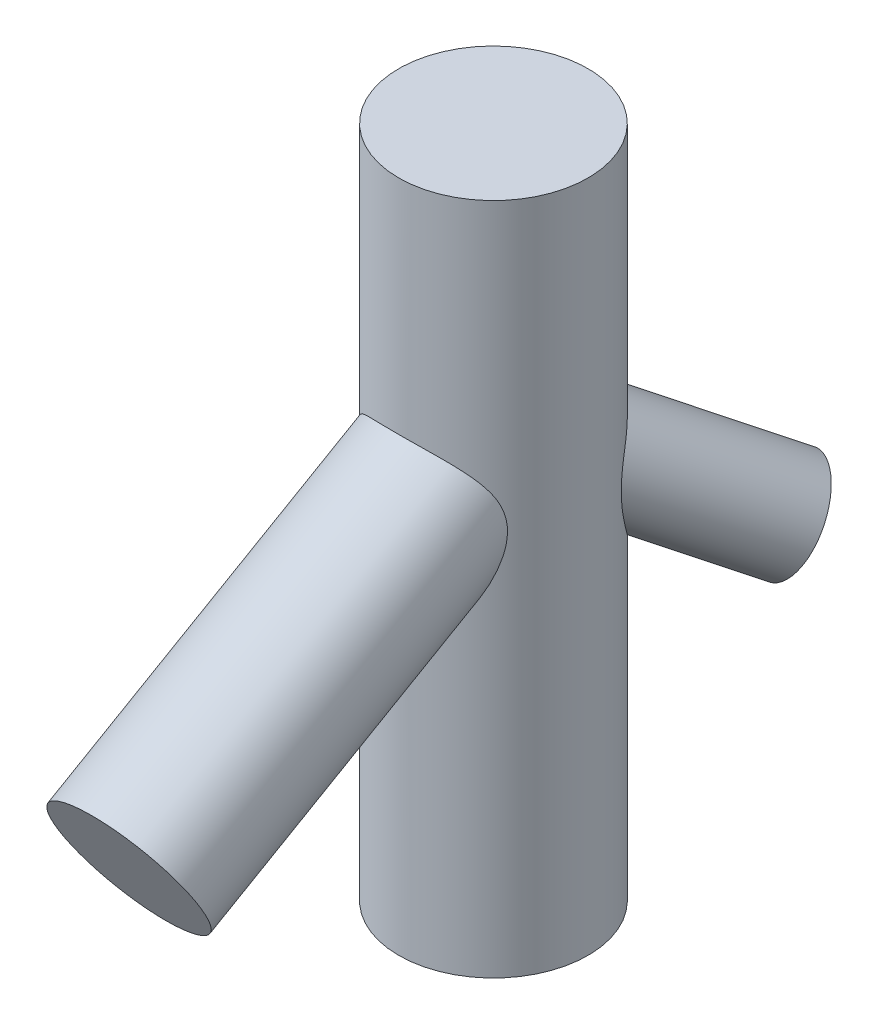
ISO-10303-21;
HEADER;
FILE_DESCRIPTION(('STEP AP214'),'2;1');
FILE_NAME('part.step','',(''),(''),'','','');
FILE_SCHEMA(('AUTOMOTIVE_DESIGN { 1 0 10303 214 1 1 1 1 }'));
ENDSEC;
DATA;
#1=APPLICATION_CONTEXT('core data for automotive mechanical design processes');
#2=APPLICATION_PROTOCOL_DEFINITION('international standard','automotive_design',2000,#1);
#3=PRODUCT_CONTEXT('',#1,'mechanical');
#4=PRODUCT('Part','Part','',(#3));
#5=PRODUCT_RELATED_PRODUCT_CATEGORY('part','',(#4));
#6=PRODUCT_DEFINITION_FORMATION('','',#4);
#7=PRODUCT_DEFINITION_CONTEXT('part definition',#1,'design');
#8=PRODUCT_DEFINITION('design','',#6,#7);
#9=PRODUCT_DEFINITION_SHAPE('','',#8);
#10=(LENGTH_UNIT() NAMED_UNIT(*) SI_UNIT(.MILLI.,.METRE.));
#11=(NAMED_UNIT(*) PLANE_ANGLE_UNIT() SI_UNIT($,.RADIAN.));
#12=(NAMED_UNIT(*) SI_UNIT($,.STERADIAN.) SOLID_ANGLE_UNIT());
#13=UNCERTAINTY_MEASURE_WITH_UNIT(LENGTH_MEASURE(1.E-05),#10,'distance_accuracy_value','');
#14=(GEOMETRIC_REPRESENTATION_CONTEXT(3) GLOBAL_UNCERTAINTY_ASSIGNED_CONTEXT((#13)) GLOBAL_UNIT_ASSIGNED_CONTEXT((#10,
#11,#12)) REPRESENTATION_CONTEXT('',''));
#15=CARTESIAN_POINT('',(0.,0.,0.));
#16=DIRECTION('',(0.,0.,1.));
#17=DIRECTION('',(1.,0.,0.));
#18=AXIS2_PLACEMENT_3D('',#15,#16,#17);
#19=CARTESIAN_POINT('',(0.,30.,0.));
#20=DIRECTION('',(0.,-1.,0.));
#21=DIRECTION('',(0.,0.,-1.));
#22=AXIS2_PLACEMENT_3D('',#19,#20,#21);
#23=CYLINDRICAL_SURFACE('',#22,11.25);
#24=CARTESIAN_POINT('',(4.1219677997383,0.232663328487408,-10.467658833661));
#25=CARTESIAN_POINT('',(4.2744260282874,0.272686896730919,-10.4076239072641));
#26=CARTESIAN_POINT('',(4.42692332365935,0.306737722652674,-10.3437185723407));
#27=CARTESIAN_POINT('',(4.73075710104342,0.362844462455498,-10.2083345912532));
#28=CARTESIAN_POINT('',(4.88209360737645,0.384900628329753,-10.1368561042295));
#29=CARTESIAN_POINT('',(5.18238453369162,0.416979488057057,-9.98666942560102));
#30=CARTESIAN_POINT('',(5.33133958642789,0.427005432596822,-9.90796319319653));
#31=CARTESIAN_POINT('',(5.62580377991612,0.435018941412209,-9.7437799673829));
#32=CARTESIAN_POINT('',(5.77131289618373,0.433006420176878,-9.65830292588397));
#33=CARTESIAN_POINT('',(6.05786819070735,0.416945412119159,-9.48119745457779));
#34=CARTESIAN_POINT('',(6.19891406055029,0.402896095421833,-9.38956860103629));
#35=CARTESIAN_POINT('',(6.47559731721168,0.362782717756057,-9.20093331082673));
#36=CARTESIAN_POINT('',(6.61123470616108,0.336718661521449,-9.10392687627745));
#37=CARTESIAN_POINT('',(6.87628094997665,0.272612130608976,-8.90542962047209));
#38=CARTESIAN_POINT('',(7.00568901447293,0.234568140524224,-8.80393823328701));
#39=CARTESIAN_POINT('',(7.25752443263587,0.146560257341407,-8.59751981373357));
#40=CARTESIAN_POINT('',(7.37995177172363,0.0965963393503007,-8.49259277419073));
#41=CARTESIAN_POINT('',(7.61722586098432,-0.0151896251998574,-8.28044103173557));
#42=CARTESIAN_POINT('',(7.73207074420211,-0.0770145776597578,-8.17321577149954));
#43=CARTESIAN_POINT('',(7.95366193729225,-0.212440628432329,-7.9577417403222));
#44=CARTESIAN_POINT('',(8.06040539640026,-0.28604584397149,-7.84949262403269));
#45=CARTESIAN_POINT('',(8.26531890527232,-0.444878492412089,-7.63342460872239));
#46=CARTESIAN_POINT('',(8.36348971211388,-0.530104897304042,-7.52560567251522));
#47=CARTESIAN_POINT('',(8.55094448993128,-0.711996796512291,-7.31191149263864));
#48=CARTESIAN_POINT('',(8.64022888496889,-0.808661744496154,-7.20603615641697));
#49=CARTESIAN_POINT('',(8.80864667132449,-1.01189855291115,-6.99912996331688));
#50=CARTESIAN_POINT('',(8.8878919956162,-1.11833303152983,-6.89805537335897));
#51=CARTESIAN_POINT('',(9.037358835686,-1.34167501581363,-6.70103954648796));
#52=CARTESIAN_POINT('',(9.10758424956068,-1.45857796004261,-6.60509610260262));
#53=CARTESIAN_POINT('',(9.23900717248544,-1.70229862590098,-6.4199790676227));
#54=CARTESIAN_POINT('',(9.30020885405079,-1.82911172337363,-6.33080235695161));
#55=CARTESIAN_POINT('',(9.41371458696094,-2.0919543855123,-6.16075757157523));
#56=CARTESIAN_POINT('',(9.466019230694,-2.22798333571857,-6.07988894383797));
#57=CARTESIAN_POINT('',(9.55913859736285,-2.50010269157921,-5.93232968638472));
#58=CARTESIAN_POINT('',(9.60044589508777,-2.6357257169601,-5.8650869115161));
#59=CARTESIAN_POINT('',(9.67562171604472,-2.91330720704228,-5.74022297038922));
#60=CARTESIAN_POINT('',(9.70949060928024,-3.05526535619697,-5.68260132558783));
#61=CARTESIAN_POINT('',(9.7701264452722,-3.34439037565864,-5.57770592628156));
#62=CARTESIAN_POINT('',(9.79689455527191,-3.49155638537188,-5.53043047126979));
#63=CARTESIAN_POINT('',(9.84373612349975,-3.78994705973653,-5.44661952161682));
#64=CARTESIAN_POINT('',(9.86380945255923,-3.94117180263605,-5.4100842341973));
#65=CARTESIAN_POINT('',(9.89733246016716,-4.24326984135044,-5.34850631335963));
#66=CARTESIAN_POINT('',(9.91091381434927,-4.39408233123403,-5.323235980674));
#67=CARTESIAN_POINT('',(9.93248360472331,-4.69747753427474,-5.28287446813104));
#68=CARTESIAN_POINT('',(9.94046990535267,-4.85006090078929,-5.26778717509402));
#69=CARTESIAN_POINT('',(9.95661534406551,-5.30913872985742,-5.23727581310022));
#70=CARTESIAN_POINT('',(9.95696646426747,-5.61701304223672,-5.23659197783929));
#71=CARTESIAN_POINT('',(9.94149645227763,-6.15409298308885,-5.26585079358322));
#72=CARTESIAN_POINT('',(9.92965044925452,-6.38393746953857,-5.28826662803975));
#73=CARTESIAN_POINT('',(9.89622136830737,-6.84064124868533,-5.35056820942147));
#74=CARTESIAN_POINT('',(9.87463387462815,-7.06749913952942,-5.39046187869781));
#75=CARTESIAN_POINT('',(9.82201972662073,-7.5172841968447,-5.48574319697942));
#76=CARTESIAN_POINT('',(9.79097284912124,-7.74020184850636,-5.54116402078862));
#77=CARTESIAN_POINT('',(9.71950507118295,-8.18062518539391,-5.66558623670139));
#78=CARTESIAN_POINT('',(9.67908533942252,-8.39813154160024,-5.73458593552592));
#79=CARTESIAN_POINT('',(9.58742337622796,-8.8326496666429,-5.88658644327361));
#80=CARTESIAN_POINT('',(9.53592040478213,-9.04949234026241,-5.96991259994308));
#81=CARTESIAN_POINT('',(9.42223787193158,-9.47568751523728,-6.14777013080543));
#82=CARTESIAN_POINT('',(9.36005695860739,-9.68503906409109,-6.24230292338512));
#83=CARTESIAN_POINT('',(9.22429114418454,-10.0948843465049,-6.44122992834118));
#84=CARTESIAN_POINT('',(9.15071889738235,-10.2953875955711,-6.5456131485201));
#85=CARTESIAN_POINT('',(8.99106882892437,-10.6863325886053,-6.76323872152206));
#86=CARTESIAN_POINT('',(8.90499464641655,-10.8767772385751,-6.87647849190859));
#87=CARTESIAN_POINT('',(8.74281398338122,-11.1985402094689,-7.08082503610802));
#88=CARTESIAN_POINT('',(8.66978718482675,-11.3325246241997,-7.17018660554723));
#89=CARTESIAN_POINT('',(8.51543744608961,-11.592909088545,-7.35283148265805));
#90=CARTESIAN_POINT('',(8.43411281623191,-11.7193075850948,-7.44611558678696));
#91=CARTESIAN_POINT('',(8.26263061167032,-11.9630634536389,-7.63595187654638));
#92=CARTESIAN_POINT('',(8.17248516475305,-12.0804328537329,-7.73249945883063));
#93=CARTESIAN_POINT('',(7.98267159566831,-12.3047260943197,-7.928308631763));
#94=CARTESIAN_POINT('',(7.88300297267575,-12.4116493848515,-8.0275703649525));
#95=CARTESIAN_POINT('',(7.62136327348813,-12.6633322040139,-8.27794203137568));
#96=CARTESIAN_POINT('',(7.4530276219322,-12.8005212830352,-8.43032656531072));
#97=CARTESIAN_POINT('',(7.18323864413596,-12.9796057768436,-8.65895518670697));
#98=CARTESIAN_POINT('',(7.09044159525934,-13.0348451667253,-8.73516319756638));
#99=CARTESIAN_POINT('',(6.89919330741388,-13.1354279307296,-8.88698523335245));
#100=CARTESIAN_POINT('',(6.80074521712791,-13.1807767494156,-8.96259956287597));
#101=CARTESIAN_POINT('',(6.61410246329382,-13.2544359965724,-9.10096135664635));
#102=CARTESIAN_POINT('',(6.52665798135008,-13.2842939851367,-9.16389994760398));
#103=CARTESIAN_POINT('',(6.34837502619577,-13.3356493906355,-9.2882957229259));
#104=CARTESIAN_POINT('',(6.25753821040608,-13.357150833307,-9.34975360719684));
#105=CARTESIAN_POINT('',(6.07296501749384,-13.3913697203228,-9.47067917668261));
#106=CARTESIAN_POINT('',(5.97922951335129,-13.4040897828954,-9.53014745007729));
#107=CARTESIAN_POINT('',(5.78945446737853,-13.4204824267712,-9.64661133136779));
#108=CARTESIAN_POINT('',(5.69341492304912,-13.42415499826,-9.70360693658131));
#109=CARTESIAN_POINT('',(5.49967707027862,-13.4223698089601,-9.81470988723022));
#110=CARTESIAN_POINT('',(5.40197768482506,-13.4169058769237,-9.86881525497931));
#111=CARTESIAN_POINT('',(5.20569624752784,-13.3969537068606,-9.97374641806165));
#112=CARTESIAN_POINT('',(5.10711384801078,-13.3824617450144,-10.0245708505456));
#113=CARTESIAN_POINT('',(4.90981998030842,-13.3447543386203,-10.122663121021));
#114=CARTESIAN_POINT('',(4.81110848369891,-13.3215364509998,-10.1699299585093));
#115=CARTESIAN_POINT('',(4.61425867061405,-13.2668394211234,-10.2607443820493));
#116=CARTESIAN_POINT('',(4.51612047418525,-13.2353586078605,-10.3042912134424));
#117=CARTESIAN_POINT('',(4.29859839533276,-13.156573472444,-10.3971899210465));
#118=CARTESIAN_POINT('',(4.17951377427062,-13.1072954029016,-10.4455767489516));
#119=CARTESIAN_POINT('',(3.94406068967039,-12.9982745445164,-10.5367381362025));
#120=CARTESIAN_POINT('',(3.82769276351315,-12.9385297048211,-10.5795115927896));
#121=CARTESIAN_POINT('',(3.48339078103626,-12.7451869420743,-10.6998870647951));
#122=CARTESIAN_POINT('',(3.2604084400184,-12.597537264327,-10.7694814393723));
#123=CARTESIAN_POINT('',(2.89270654990003,-12.3199656851653,-10.8729107830176));
#124=CARTESIAN_POINT('',(2.74380375908097,-12.1969976911428,-10.9112835838958));
#125=CARTESIAN_POINT('',(2.45495271547673,-11.9388488561875,-10.979877443296));
#126=CARTESIAN_POINT('',(2.31500474935173,-11.8036676246206,-11.0100982409571));
#127=CARTESIAN_POINT('',(2.04407926626692,-11.5228100584538,-11.0636052701596));
#128=CARTESIAN_POINT('',(1.91312191168426,-11.3771115472435,-11.0868762837213));
#129=CARTESIAN_POINT('',(1.66062844757483,-11.0770371153941,-11.127495379059));
#130=CARTESIAN_POINT('',(1.53909210601533,-10.9226614086297,-11.1448436067446));
#131=CARTESIAN_POINT('',(1.26228848981448,-10.5478753110057,-11.1801240009025));
#132=CARTESIAN_POINT('',(1.11118830323293,-10.3241740197148,-11.1958952450869));
#133=CARTESIAN_POINT('',(0.827282675634012,-9.86502051100599,-11.2204454526936));
#134=CARTESIAN_POINT('',(0.6944849335211,-9.62956340490528,-11.2292214809655));
#135=CARTESIAN_POINT('',(0.448080029283202,-9.14866479570988,-11.2417496886282));
#136=CARTESIAN_POINT('',(0.3344743483821,-8.90322252378246,-11.2455014804082));
#137=CARTESIAN_POINT('',(0.127875152994895,-8.4038428839127,-11.2497476394437));
#138=CARTESIAN_POINT('',(0.0348743140489416,-8.14990857172217,-11.2502431660137));
#139=CARTESIAN_POINT('',(-0.110544082593304,-7.6915491297208,-11.2496368988339));
#140=CARTESIAN_POINT('',(-0.167388720880067,-7.4885225258489,-11.2488625348472));
#141=CARTESIAN_POINT('',(-0.266078324943659,-7.07882274695658,-11.2469616626193));
#142=CARTESIAN_POINT('',(-0.307923593768939,-6.87214964569882,-11.2458351614935));
#143=CARTESIAN_POINT('',(-0.375050027316577,-6.4565246015276,-11.243796827935));
#144=CARTESIAN_POINT('',(-0.400364198377069,-6.24757805161127,-11.2428845700875));
#145=CARTESIAN_POINT('',(-0.432879031901175,-5.82826926347701,-11.2416813743334));
#146=CARTESIAN_POINT('',(-0.44008454010301,-5.6179074190916,-11.241390270214));
#147=CARTESIAN_POINT('',(-0.435265892699095,-5.24341723789391,-11.2415759867814));
#148=CARTESIAN_POINT('',(-0.427101588800512,-5.07923621870066,-11.2418988271117));
#149=CARTESIAN_POINT('',(-0.397920621786431,-4.75203267709076,-11.2429702709478));
#150=CARTESIAN_POINT('',(-0.376907020114924,-4.58900988807361,-11.2437187730336));
#151=CARTESIAN_POINT('',(-0.321435504552436,-4.26533518052178,-11.2454412317061));
#152=CARTESIAN_POINT('',(-0.286984298372775,-4.10468212053774,-11.2464150757095));
#153=CARTESIAN_POINT('',(-0.204271138596491,-3.78695231386036,-11.2482213539532));
#154=CARTESIAN_POINT('',(-0.156009070878153,-3.62987559673059,-11.249053787025));
#155=CARTESIAN_POINT('',(-0.0453431550063586,-3.31986284960285,-11.2500452465901));
#156=CARTESIAN_POINT('',(0.0171318790871616,-3.16695215663155,-11.2502008011622));
#157=CARTESIAN_POINT('',(0.155765989503136,-2.86746255558237,-11.2491348853879));
#158=CARTESIAN_POINT('',(0.231925223084605,-2.72088372029431,-11.2479133992158));
#159=CARTESIAN_POINT('',(0.397262953504992,-2.43526514548299,-11.2432875966435));
#160=CARTESIAN_POINT('',(0.486443830995811,-2.29622679091883,-11.2398828807126));
#161=CARTESIAN_POINT('',(0.676829520549814,-2.02676549250181,-11.2300257776637));
#162=CARTESIAN_POINT('',(0.778033941132315,-1.89634226835953,-11.2235734897527));
#163=CARTESIAN_POINT('',(0.983072431959209,-1.65458659662778,-11.2074000077633));
#164=CARTESIAN_POINT('',(1.08610991366299,-1.54255712781952,-11.1979673842622));
#165=CARTESIAN_POINT('',(1.30039051827682,-1.32699495087463,-11.1751105374205));
#166=CARTESIAN_POINT('',(1.41163695380483,-1.22346570889298,-11.1616846959715));
#167=CARTESIAN_POINT('',(1.6412050512986,-1.02530970218914,-11.1302455866651));
#168=CARTESIAN_POINT('',(1.75952761578812,-0.930684077055124,-11.1122317326715));
#169=CARTESIAN_POINT('',(2.00212003857802,-0.750605213867103,-11.0710954958176));
#170=CARTESIAN_POINT('',(2.12639043746126,-0.665152811840558,-11.0479726479212));
#171=CARTESIAN_POINT('',(2.4001925570555,-0.490589362843909,-10.9920018551866));
#172=CARTESIAN_POINT('',(2.55056856185962,-0.403106832385144,-10.9581872941063));
#173=CARTESIAN_POINT('',(2.85615283476934,-0.240966159409339,-10.8825398856558));
#174=CARTESIAN_POINT('',(3.01136173003712,-0.16630968958664,-10.8407059939579));
#175=CARTESIAN_POINT('',(3.32499772937924,-0.0299555855649138,-10.7486559424568));
#176=CARTESIAN_POINT('',(3.4834255590231,0.031739090608053,-10.6984378739734));
#177=CARTESIAN_POINT('',(3.80187724731845,0.142037590748546,-10.589454530405));
#178=CARTESIAN_POINT('',(3.96190099179826,0.190642344299954,-10.5306898627153));
#179=CARTESIAN_POINT('',(4.1219677997383,0.232663328487408,-10.467658833661));
#180=B_SPLINE_CURVE_WITH_KNOTS('',3,(#24,#25,#26,#27,#28,#29,#30,#31,#32,#33,#34,#35,#36,#37,
#38,#39,#40,#41,#42,#43,#44,#45,#46,#47,#48,#49,#50,#51,#52,#53,#54,#55,#56,#57,#58,#59,#60,#61,
#62,#63,#64,#65,#66,#67,#68,#69,#70,#71,#72,#73,#74,#75,#76,#77,#78,#79,#80,#81,#82,#83,#84,#85,
#86,#87,#88,#89,#90,#91,#92,#93,#94,#95,#96,#97,#98,#99,#100,#101,#102,#103,#104,#105,#106,#107,
#108,#109,#110,#111,#112,#113,#114,#115,#116,#117,#118,#119,#120,#121,#122,#123,#124,#125,#126,
#127,#128,#129,#130,#131,#132,#133,#134,#135,#136,#137,#138,#139,#140,#141,#142,#143,#144,#145,
#146,#147,#148,#149,#150,#151,#152,#153,#154,#155,#156,#157,#158,#159,#160,#161,#162,#163,#164,
#165,#166,#167,#168,#169,#170,#171,#172,#173,#174,#175,#176,#177,#178,#179),.UNSPECIFIED.,.T.,
.F.,(4,2,2,2,2,2,2,2,2,2,2,2,2,2,2,2,2,2,2,2,2,2,2,2,2,2,2,2,2,2,2,2,2,2,2,2,2,2,2,2,2,2,2,2,2,
2,2,2,2,2,2,2,2,2,2,2,2,2,2,2,2,2,2,2,2,2,2,2,2,2,2,2,2,2,2,2,2,4),(0.,0.505852935654791,
1.01169524354541,1.51740083695816,2.02311002247469,2.52885407683612,3.03459793193309,
3.54040578703274,4.04621469844798,4.5521476894202,5.05825789272743,5.56432335457572,
6.07036465526457,6.5701444996223,7.06970762425594,7.56903902480084,8.06833716551897,
8.5384807911764,9.00860102550002,9.47864393240955,9.94869590777053,10.4087603031396,
10.869000203855,11.7893213587261,12.4822078907512,13.1754088197844,13.8701022642122,
14.5647091355377,15.2779096544942,15.9912005374468,16.7037046575829,17.4160017913142,
17.9461503449873,18.4764070682829,19.0059447178432,19.5355102312024,20.3279913898704,
20.7241263282414,21.1200426486886,21.455098200027,21.7899921388404,22.1247861835611,
22.4595805914506,22.79460122745,23.1297601420301,23.4650129639254,23.8003336361251,
24.2126974227255,24.6251420981828,25.4505411483871,26.0405340786015,26.6305458861206,
27.2218403292921,27.8131202046801,28.6232704681917,29.4337604871831,30.2443130304257,
31.0545769803844,31.6865812290054,32.3185727078426,32.9492984495441,33.5798553959325,
34.0725502672907,34.5651277960225,35.0574597565746,35.5497957854747,36.0446542049235,
36.539518311656,37.0344730043167,37.5294115859089,37.986401468027,38.4435767818037,
38.9008105308117,39.3580859157871,39.8890314312585,40.420046136837,40.9511818945839,
41.4822799236501),.UNSPECIFIED.);
#181=CARTESIAN_POINT('',(4.1219677997383,0.232663328487408,-10.467658833661));
#182=VERTEX_POINT('',#181);
#183=EDGE_CURVE('E90',#182,#182,#180,.T.);
#184=ORIENTED_EDGE('',*,*,#183,.F.);
#185=EDGE_LOOP('',(#184));
#186=FACE_BOUND('',#185,.T.);
#187=CARTESIAN_POINT('',(0.,-16.5988202392018,11.25));
#188=CARTESIAN_POINT('',(0.146727367038391,-16.598820862974,11.250000322221));
#189=CARTESIAN_POINT('',(0.293449610849985,-16.5928890027756,11.2471229899579));
#190=CARTESIAN_POINT('',(0.585714121760302,-16.569314856245,11.2356942519123));
#191=CARTESIAN_POINT('',(0.731256458710403,-16.5516732683383,11.227143184539));
#192=CARTESIAN_POINT('',(1.02017083371265,-16.5050955348832,11.204586630411));
#193=CARTESIAN_POINT('',(1.16354154317198,-16.4761527439473,11.1905779344461));
#194=CARTESIAN_POINT('',(1.44712365791134,-16.4076268442758,11.1574516702969));
#195=CARTESIAN_POINT('',(1.58733435231512,-16.3680413667549,11.1383329647627));
#196=CARTESIAN_POINT('',(1.89496927730635,-16.2690108385807,11.090579426211));
#197=CARTESIAN_POINT('',(2.061421294719,-16.2071015648884,11.0607714230867));
#198=CARTESIAN_POINT('',(2.38751890524168,-16.0701535738604,10.9949972353876));
#199=CARTESIAN_POINT('',(2.54716297300475,-15.9951119331905,10.9590296797022));
#200=CARTESIAN_POINT('',(3.01546646716958,-15.752524876791,10.8431031197857));
#201=CARTESIAN_POINT('',(3.31328305554863,-15.5675897698017,10.7551553790479));
#202=CARTESIAN_POINT('',(3.81032173491782,-15.2121120671117,10.5875088260915));
#203=CARTESIAN_POINT('',(4.01601574353702,-15.0488285653473,10.5109239363005));
#204=CARTESIAN_POINT('',(4.41100321883056,-14.7061087406795,10.3513710323874));
#205=CARTESIAN_POINT('',(4.60028775332539,-14.5266637275783,10.2683995876815));
#206=CARTESIAN_POINT('',(4.96365056180021,-14.1543643622231,10.0977754136568));
#207=CARTESIAN_POINT('',(5.13769564103327,-13.9614823043363,10.0101131040563));
#208=CARTESIAN_POINT('',(5.47131532813064,-13.5648443426552,9.83173374192377));
#209=CARTESIAN_POINT('',(5.6308849838832,-13.3610847551908,9.74101565844282));
#210=CARTESIAN_POINT('',(5.91076268287564,-12.9795559998934,9.57326076661014));
#211=CARTESIAN_POINT('',(6.03315733437785,-12.8031880253562,9.49649252781653));
#212=CARTESIAN_POINT('',(6.26914395325939,-12.4448687245211,9.34238703094177));
#213=CARTESIAN_POINT('',(6.38273474789312,-12.2629166588676,9.26504969854997));
#214=CARTESIAN_POINT('',(6.60161862441447,-11.893915660678,9.11038410605191));
#215=CARTESIAN_POINT('',(6.70690624634241,-11.7068634814337,9.03305588475754));
#216=CARTESIAN_POINT('',(6.90948515703358,-11.3282106530137,8.87905971199192));
#217=CARTESIAN_POINT('',(7.0067761963664,-11.1366098621973,8.80239178118326));
#218=CARTESIAN_POINT('',(7.19370608136165,-10.7490959158993,8.65029577923261));
#219=CARTESIAN_POINT('',(7.283340954724,-10.5531805873863,8.57486836790807));
#220=CARTESIAN_POINT('',(7.45510904740751,-10.1573931271822,8.42595783368434));
#221=CARTESIAN_POINT('',(7.53724308641457,-9.95752143075158,8.3524744989627));
#222=CARTESIAN_POINT('',(7.69410695274632,-9.55406384829519,8.20820109082132));
#223=CARTESIAN_POINT('',(7.76884049973909,-9.35047988970302,8.13740967551261));
#224=CARTESIAN_POINT('',(7.9109662947646,-8.93962397279167,7.99930804805738));
#225=CARTESIAN_POINT('',(7.97835918797444,-8.73235234045151,7.93199753024501));
#226=CARTESIAN_POINT('',(8.11949657993557,-8.26893808862669,7.78771699408912));
#227=CARTESIAN_POINT('',(8.19146368560956,-8.01191884118993,7.71180527786311));
#228=CARTESIAN_POINT('',(8.32396029500367,-7.49261884457828,7.5685995199226));
#229=CARTESIAN_POINT('',(8.38449230322577,-7.23033926146863,7.50130359223094));
#230=CARTESIAN_POINT('',(8.49320477137462,-6.70105328621724,7.3779887791938));
#231=CARTESIAN_POINT('',(8.54140567505348,-6.43405551262439,7.32195126207426));
#232=CARTESIAN_POINT('',(8.62423876183986,-5.89535471639325,7.22420462588889));
#233=CARTESIAN_POINT('',(8.65887565933559,-5.6236533629057,7.18249052911025));
#234=CARTESIAN_POINT('',(8.70476174403787,-5.15661118339115,7.12674616934849));
#235=CARTESIAN_POINT('',(8.71988891951398,-4.96219352577455,7.1081867764734));
#236=CARTESIAN_POINT('',(8.74148280409545,-4.57218080894983,7.08161581280577));
#237=CARTESIAN_POINT('',(8.74795249245239,-4.37658617805358,7.07360061351621));
#238=CARTESIAN_POINT('',(8.75122018241732,-3.98545918303934,7.06955871065118));
#239=CARTESIAN_POINT('',(8.74803347997583,-3.78992721060015,7.0735130470385));
#240=CARTESIAN_POINT('',(8.73095082080314,-3.40000806281048,7.09458872482812));
#241=CARTESIAN_POINT('',(8.71705536573582,-3.20562083426297,7.11170944943571));
#242=CARTESIAN_POINT('',(8.67731836004711,-2.81740214794338,7.16014267017417));
#243=CARTESIAN_POINT('',(8.6513342023667,-2.62360591771306,7.19162449133269));
#244=CARTESIAN_POINT('',(8.58658292633103,-2.24103106958908,7.26881164144307));
#245=CARTESIAN_POINT('',(8.54781609207092,-2.05225234028216,7.31451665428305));
#246=CARTESIAN_POINT('',(8.45707045026193,-1.68161398655189,7.41924843380416));
#247=CARTESIAN_POINT('',(8.4050862208903,-1.49975723683021,7.47828066624204));
#248=CARTESIAN_POINT('',(8.28791194308617,-1.14465139321203,7.60793199140012));
#249=CARTESIAN_POINT('',(8.22272199706012,-0.97140223257918,7.67855099426753));
#250=CARTESIAN_POINT('',(8.09006421053408,-0.659451974348657,7.8180048559258));
#251=CARTESIAN_POINT('',(8.02435101401377,-0.51942457116728,7.88556614734432));
#252=CARTESIAN_POINT('',(7.88389478829248,-0.246689634504894,8.02599303133292));
#253=CARTESIAN_POINT('',(7.80914850094691,-0.113984767478092,8.09886053401089));
#254=CARTESIAN_POINT('',(7.65102959696011,0.143934114947735,8.24839896660504));
#255=CARTESIAN_POINT('',(7.56765593812103,0.269147222442173,8.32507035545199));
#256=CARTESIAN_POINT('',(7.39268872803131,0.512117430974099,8.48082407095121));
#257=CARTESIAN_POINT('',(7.30109400213603,0.629873462414982,8.55990674106353));
#258=CARTESIAN_POINT('',(7.09347178625369,0.877894957545279,8.73306696964858));
#259=CARTESIAN_POINT('',(6.975965712865,1.00677342842093,8.82736001258957));
#260=CARTESIAN_POINT('',(6.73080650480169,1.25467907664474,9.01568892459582));
#261=CARTESIAN_POINT('',(6.60315263921646,1.37370554312426,9.10972477463085));
#262=CARTESIAN_POINT('',(6.33822736382268,1.60222889490146,9.29599943412095));
#263=CARTESIAN_POINT('',(6.20095140183712,1.71172121395197,9.38823736625276));
#264=CARTESIAN_POINT('',(5.91741038078032,1.92134004178656,9.56948685653802));
#265=CARTESIAN_POINT('',(5.7711446743686,2.02146587478909,9.658498181612));
#266=CARTESIAN_POINT('',(5.43807610227273,2.23290543771982,9.85059545100182));
#267=CARTESIAN_POINT('',(5.24928240423091,2.3420485330159,9.95263256097901));
#268=CARTESIAN_POINT('',(4.86036196735004,2.54695218123595,10.1482403226641));
#269=CARTESIAN_POINT('',(4.66023387605838,2.64271113237753,10.2418099605335));
#270=CARTESIAN_POINT('',(4.24973866813161,2.82090174163331,10.4188383668891));
#271=CARTESIAN_POINT('',(4.03936855308151,2.9033294660531,10.502294149228));
#272=CARTESIAN_POINT('',(3.60970617831319,3.05476108251866,10.6576126500343));
#273=CARTESIAN_POINT('',(3.3904140584096,3.12376518482493,10.7294755500834));
#274=CARTESIAN_POINT('',(2.93646512106296,3.25041074274138,10.8626680545637));
#275=CARTESIAN_POINT('',(2.70153917211018,3.30757003716964,10.9235410206843));
#276=CARTESIAN_POINT('',(2.22526655833896,3.40721667923574,11.0304241176346));
#277=CARTESIAN_POINT('',(1.98391966330722,3.44970350004862,11.0764337147813));
#278=CARTESIAN_POINT('',(1.4966817936558,3.51983577677737,11.1527231182364));
#279=CARTESIAN_POINT('',(1.25079192575127,3.54748479928013,11.1830067045763));
#280=CARTESIAN_POINT('',(0.756338669379262,3.58783498834402,11.2272906333603));
#281=CARTESIAN_POINT('',(0.50777540903731,3.6005368680718,11.2412917526824));
#282=CARTESIAN_POINT('',(0.0212363449941378,3.61070019193622,11.2524912267204));
#283=CARTESIAN_POINT('',(-0.216709268417098,3.60882564094603,11.250421660698));
#284=CARTESIAN_POINT('',(-0.691485878869276,3.59140916522984,11.2312415690258));
#285=CARTESIAN_POINT('',(-0.928316909671685,3.57586765719918,11.2141315019495));
#286=CARTESIAN_POINT('',(-1.39912383516976,3.53118616488982,11.165167405307));
#287=CARTESIAN_POINT('',(-1.63310004121941,3.50204767738206,11.1333149985972));
#288=CARTESIAN_POINT('',(-2.09657431353937,3.43028555901877,11.0554102736546));
#289=CARTESIAN_POINT('',(-2.32607234943058,3.38766183671554,11.0093578591269));
#290=CARTESIAN_POINT('',(-2.77708941017831,3.28949273667692,10.9042850138816));
#291=CARTESIAN_POINT('',(-2.99865992521041,3.23406111169256,10.8453789841511));
#292=CARTESIAN_POINT('',(-3.43445884320178,3.11022062753818,10.715348807635));
#293=CARTESIAN_POINT('',(-3.64868729522184,3.04181185510341,10.6442247425113));
#294=CARTESIAN_POINT('',(-4.06861029203825,2.89209434933451,10.4908957435363));
#295=CARTESIAN_POINT('',(-4.27430098865483,2.81077987704404,10.4086858824676));
#296=CARTESIAN_POINT('',(-4.67587534705684,2.63532418360533,10.2345779960912));
#297=CARTESIAN_POINT('',(-4.87175879329871,2.54118268071393,10.1426797579901));
#298=CARTESIAN_POINT('',(-5.26099571093609,2.33562262811362,9.94655548710668));
#299=CARTESIAN_POINT('',(-5.45386182986564,2.22362760535906,9.84196563566286));
#300=CARTESIAN_POINT('',(-5.82660994535571,1.9854295898538,9.62598126505321));
#301=CARTESIAN_POINT('',(-6.00649056287096,1.85922509170544,9.5145860254755));
#302=CARTESIAN_POINT('',(-6.35212714783219,1.5922995946557,9.2873970689091));
#303=CARTESIAN_POINT('',(-6.5178845533034,1.45158007690645,9.17160380146747));
#304=CARTESIAN_POINT('',(-6.83415882489075,1.15515739759671,8.93841932505221));
#305=CARTESIAN_POINT('',(-6.98467933368094,0.999457834748321,8.82102850565355));
#306=CARTESIAN_POINT('',(-7.23865225478696,0.707779630246888,8.61308720420737));
#307=CARTESIAN_POINT('',(-7.3452590956133,0.574777959666539,8.52220233508634));
#308=CARTESIAN_POINT('',(-7.54777855338432,0.299034260798818,8.3433670176504));
#309=CARTESIAN_POINT('',(-7.64369366865119,0.156294520613663,8.2554158871926));
#310=CARTESIAN_POINT('',(-7.82409370096298,-0.138773714686463,8.08464390171414));
#311=CARTESIAN_POINT('',(-7.90859668033186,-0.29108648472378,8.00181505488583));
#312=CARTESIAN_POINT('',(-8.06577303924279,-0.605299442333277,7.84335809228693));
#313=CARTESIAN_POINT('',(-8.13844649718362,-0.767199566356681,7.76772992879602));
#314=CARTESIAN_POINT('',(-8.27213370585117,-1.10157965655392,7.62521840988673));
#315=CARTESIAN_POINT('',(-8.33302818937825,-1.2741466322375,7.55842647165284));
#316=CARTESIAN_POINT('',(-8.44201427752231,-1.62726199262987,7.43650434786927));
#317=CARTESIAN_POINT('',(-8.49010689087043,-1.80780974718034,7.38137324356746));
#318=CARTESIAN_POINT('',(-8.57356739288455,-2.17520448449741,7.28426755146404));
#319=CARTESIAN_POINT('',(-8.60893953161412,-2.36204934046417,7.24228856998488));
#320=CARTESIAN_POINT('',(-8.6674595830761,-2.74018568345895,7.17214980600877));
#321=CARTESIAN_POINT('',(-8.69060636704777,-2.93147757937816,7.14399129956618));
#322=CARTESIAN_POINT('',(-8.72670232446944,-3.33006815235134,7.09986220845543));
#323=CARTESIAN_POINT('',(-8.73882393352995,-3.53754972322455,7.0848831299875));
#324=CARTESIAN_POINT('',(-8.75123121678135,-3.953368999286,7.06954977434553));
#325=CARTESIAN_POINT('',(-8.75151519977143,-4.16170682255193,7.06919758686498));
#326=CARTESIAN_POINT('',(-8.74152250158438,-4.57818055030249,7.08154910484604));
#327=CARTESIAN_POINT('',(-8.73122100842081,-4.78631483053099,7.09428348477073));
#328=CARTESIAN_POINT('',(-8.70119410176348,-5.20092545121415,7.13107779055939));
#329=CARTESIAN_POINT('',(-8.68146467112602,-5.40740104675286,7.15514254411044));
#330=CARTESIAN_POINT('',(-8.61653634921137,-5.96426638779762,7.23339075012913));
#331=CARTESIAN_POINT('',(-8.56320549877898,-6.31241830611698,7.29681831686082));
#332=CARTESIAN_POINT('',(-8.43545148933344,-7.00044878546168,7.44413350212497));
#333=CARTESIAN_POINT('',(-8.3610114130029,-7.34032047235835,7.52803752331206));
#334=CARTESIAN_POINT('',(-8.19284681891051,-8.01214643184269,7.71072154060646));
#335=CARTESIAN_POINT('',(-8.09907101148815,-8.34407697140736,7.80954091017616));
#336=CARTESIAN_POINT('',(-7.89332274599201,-8.99878316719991,8.01744054426012));
#337=CARTESIAN_POINT('',(-7.78135576753506,-9.32156154599584,8.12651771472453));
#338=CARTESIAN_POINT('',(-7.52606299123254,-9.99262073864182,8.36388138831341));
#339=CARTESIAN_POINT('',(-7.38064620510619,-10.3398257925916,8.49296364916267));
#340=CARTESIAN_POINT('',(-7.06672641325532,-11.0219362168684,8.75590369108011));
#341=CARTESIAN_POINT('',(-6.8982163196043,-11.3568377707627,8.88976292895924));
#342=CARTESIAN_POINT('',(-6.53714105317,-12.0115156526547,9.15853816898813));
#343=CARTESIAN_POINT('',(-6.34465096544577,-12.3313350751294,9.29344969161151));
#344=CARTESIAN_POINT('',(-5.93302538680506,-12.9540432427421,9.56148768372601));
#345=CARTESIAN_POINT('',(-5.71390707123658,-13.2569427192061,9.69461524299592));
#346=CARTESIAN_POINT('',(-5.35191155518294,-13.709295323076,9.89651537994831));
#347=CARTESIAN_POINT('',(-5.21935389001633,-13.8662090193336,9.96717158757538));
#348=CARTESIAN_POINT('',(-4.94483169042147,-14.1726359486586,10.1061771983945));
#349=CARTESIAN_POINT('',(-4.80286931165561,-14.322150863975,10.1745271248273));
#350=CARTESIAN_POINT('',(-4.50897478920703,-14.6125659617359,10.3081377272183));
#351=CARTESIAN_POINT('',(-4.3570421453331,-14.753465711286,10.373398247903));
#352=CARTESIAN_POINT('',(-4.04271703413941,-15.0250753317639,10.4998872081411));
#353=CARTESIAN_POINT('',(-3.88032593444341,-15.1557865300997,10.5611161727809));
#354=CARTESIAN_POINT('',(-3.57073626678455,-15.3857713894158,10.6693438609863));
#355=CARTESIAN_POINT('',(-3.42508429933452,-15.4867775329833,10.7170772464806));
#356=CARTESIAN_POINT('',(-3.12591312834969,-15.6788033427021,10.8081273449268));
#357=CARTESIAN_POINT('',(-2.97239162717959,-15.7698200676391,10.8514427568174));
#358=CARTESIAN_POINT('',(-2.65782731077898,-15.9401747982934,10.9327403765824));
#359=CARTESIAN_POINT('',(-2.49679248699188,-16.019524856165,10.9707280862975));
#360=CARTESIAN_POINT('',(-2.16760531374213,-16.1649089200445,11.0404825392117));
#361=CARTESIAN_POINT('',(-1.99945804514186,-16.2309522438083,11.0722536350088));
#362=CARTESIAN_POINT('',(-1.68231193167783,-16.3393487872171,11.124485615558));
#363=CARTESIAN_POINT('',(-1.5341794146422,-16.3837638270621,11.1459255545408));
#364=CARTESIAN_POINT('',(-1.23422296228408,-16.4607216752219,11.1831126759661));
#365=CARTESIAN_POINT('',(-1.08240109854436,-16.4932709890692,11.19886297778));
#366=CARTESIAN_POINT('',(-0.776180603181485,-16.5456882214094,11.2242428301839));
#367=CARTESIAN_POINT('',(-0.621783936208634,-16.5655653921819,11.2338768464203));
#368=CARTESIAN_POINT('',(-0.311589548514346,-16.5921307955144,11.2467551273192));
#369=CARTESIAN_POINT('',(-0.155791886364764,-16.5988195768941,11.2499996578728));
#370=CARTESIAN_POINT('',(0.,-16.5988202392018,11.25));
#371=B_SPLINE_CURVE_WITH_KNOTS('',3,(#187,#188,#189,#190,#191,#192,#193,#194,#195,#196,#197,
#198,#199,#200,#201,#202,#203,#204,#205,#206,#207,#208,#209,#210,#211,#212,#213,#214,#215,#216,
#217,#218,#219,#220,#221,#222,#223,#224,#225,#226,#227,#228,#229,#230,#231,#232,#233,#234,#235,
#236,#237,#238,#239,#240,#241,#242,#243,#244,#245,#246,#247,#248,#249,#250,#251,#252,#253,#254,
#255,#256,#257,#258,#259,#260,#261,#262,#263,#264,#265,#266,#267,#268,#269,#270,#271,#272,#273,
#274,#275,#276,#277,#278,#279,#280,#281,#282,#283,#284,#285,#286,#287,#288,#289,#290,#291,#292,
#293,#294,#295,#296,#297,#298,#299,#300,#301,#302,#303,#304,#305,#306,#307,#308,#309,#310,#311,
#312,#313,#314,#315,#316,#317,#318,#319,#320,#321,#322,#323,#324,#325,#326,#327,#328,#329,#330,
#331,#332,#333,#334,#335,#336,#337,#338,#339,#340,#341,#342,#343,#344,#345,#346,#347,#348,#349,
#350,#351,#352,#353,#354,#355,#356,#357,#358,#359,#360,#361,#362,#363,#364,#365,#366,#367,#368,
#369,#370),.UNSPECIFIED.,.T.,.F.,(4,2,2,2,2,2,2,2,2,2,2,2,2,2,2,2,2,2,2,2,2,2,2,2,2,2,2,2,2,2,2,
2,2,2,2,2,2,2,2,2,2,2,2,2,2,2,2,2,2,2,2,2,2,2,2,2,2,2,2,2,2,2,2,2,2,2,2,2,2,2,2,2,2,2,2,2,2,2,2,
2,2,2,2,2,2,2,2,2,2,2,2,4),(0.,0.440027060603908,0.880027878203026,1.3202878177765,
1.76064582901082,2.30004869768299,2.83957179336892,3.91929567141569,4.73900157962476,
5.55915091340356,6.38104443247278,7.20321807317378,7.88694439387265,8.57076163651868,
9.25502485456008,9.93930940813181,10.6239468639821,11.3085094133819,11.9927261196155,
12.6768826407786,13.5089688693398,14.3408726434993,15.1713881322913,16.001614705344,
16.5888706517903,17.1759244571892,17.7620488418945,18.3481457705961,18.9413392042601,
19.5345194550815,20.1279434242388,20.7213627917444,21.2272427113536,21.7333056444026,
22.2394297820472,22.7456263513266,23.3398736011266,23.9341636913617,24.528736860771,
25.1233528949413,25.844830684181,26.5663947443617,27.2881713321911,28.0099366135833,
28.7569609395398,29.5040120851153,30.2508835802097,30.9977194386979,31.7107406716914,
32.4237401659527,33.1366611909286,33.8495870505533,34.5564092105862,35.2632266466035,
35.9703592781299,36.6775074441883,37.4156555877134,38.1538820067492,38.8920331695342,
39.6300074441995,40.2090089707474,40.7878749178574,41.3658136620616,41.9437485758877,
42.5272598311918,43.1107250947529,43.6939952340372,44.2773192169445,44.901489439279,
45.5257488343553,46.1514748168497,46.7774676525709,47.8493055396309,48.9220048565345,
49.9975870743945,51.0728458997583,52.2657999371826,53.4591209461707,54.6487952137961,
55.8377061678901,56.4890950231498,57.1403350861701,57.7916078458084,58.4427956125311,
58.9930493354146,59.5434646389633,60.0933072839968,60.6427635650755,61.1105927090463,
61.578164972715,62.0453954568799,62.5126064973744),.UNSPECIFIED.);
#372=CARTESIAN_POINT('',(0.,-16.5988202392018,11.25));
#373=VERTEX_POINT('',#372);
#374=EDGE_CURVE('E47',#373,#373,#371,.T.);
#375=ORIENTED_EDGE('',*,*,#374,.F.);
#376=EDGE_LOOP('',(#375));
#377=FACE_BOUND('',#376,.T.);
#378=CARTESIAN_POINT('',(0.,30.,0.));
#379=DIRECTION('',(0.,1.,0.));
#380=DIRECTION('',(0.,0.,1.));
#381=AXIS2_PLACEMENT_3D('',#378,#379,#380);
#382=CIRCLE('',#381,11.25);
#383=CARTESIAN_POINT('',(0.,30.,11.25));
#384=VERTEX_POINT('',#383);
#385=EDGE_CURVE('E10',#384,#384,#382,.T.);
#386=ORIENTED_EDGE('',*,*,#385,.F.);
#387=EDGE_LOOP('',(#386));
#388=FACE_BOUND('',#387,.T.);
#389=CARTESIAN_POINT('',(0.,-50.,0.));
#390=DIRECTION('',(0.,1.,0.));
#391=DIRECTION('',(0.,0.,1.));
#392=AXIS2_PLACEMENT_3D('',#389,#390,#391);
#393=CIRCLE('',#392,11.25);
#394=CARTESIAN_POINT('',(0.,-50.,11.25));
#395=VERTEX_POINT('',#394);
#396=EDGE_CURVE('E43',#395,#395,#393,.T.);
#397=ORIENTED_EDGE('',*,*,#396,.T.);
#398=EDGE_LOOP('',(#397));
#399=FACE_BOUND('',#398,.T.);
#400=ADVANCED_FACE('F37',(#186,#377,#388,#399),#23,.T.);
#401=CARTESIAN_POINT('',(0.,30.,0.));
#402=DIRECTION('',(0.,1.,0.));
#403=DIRECTION('',(0.,0.,1.));
#404=AXIS2_PLACEMENT_3D('',#401,#402,#403);
#405=PLANE('',#404);
#406=ORIENTED_EDGE('',*,*,#385,.T.);
#407=EDGE_LOOP('',(#406));
#408=FACE_BOUND('',#407,.T.);
#409=ADVANCED_FACE('F79',(#408),#405,.T.);
#410=CARTESIAN_POINT('',(0.,-50.,0.));
#411=DIRECTION('',(0.,1.,0.));
#412=DIRECTION('',(0.,0.,1.));
#413=AXIS2_PLACEMENT_3D('',#410,#411,#412);
#414=PLANE('',#413);
#415=ORIENTED_EDGE('',*,*,#396,.F.);
#416=EDGE_LOOP('',(#415));
#417=FACE_BOUND('',#416,.T.);
#418=ADVANCED_FACE('F71',(#417),#414,.F.);
#419=CARTESIAN_POINT('',(0.,-25.0000000000001,43.3012701892219));
#420=DIRECTION('',(0.,-0.500000000000001,0.866025403784438));
#421=DIRECTION('',(0.,-0.866025403784438,-0.500000000000001));
#422=AXIS2_PLACEMENT_3D('',#419,#420,#421);
#423=PLANE('',#422);
#424=CARTESIAN_POINT('',(0.,-25.0000000000001,43.3012701892219));
#425=DIRECTION('',(0.,-0.500000000000001,0.866025403784438));
#426=DIRECTION('',(0.,-0.866025403784438,-0.500000000000001));
#427=AXIS2_PLACEMENT_3D('',#424,#425,#426);
#428=CIRCLE('',#427,8.75);
#429=CARTESIAN_POINT('',(0.,-32.5777222831139,38.9262701892219));
#430=VERTEX_POINT('',#429);
#431=EDGE_CURVE('E51',#430,#430,#428,.T.);
#432=ORIENTED_EDGE('',*,*,#431,.T.);
#433=EDGE_LOOP('',(#432));
#434=FACE_BOUND('',#433,.T.);
#435=ADVANCED_FACE('F69',(#434),#423,.T.);
#436=CARTESIAN_POINT('',(0.,12.3720759089894,-21.4290640694685));
#437=DIRECTION('',(0.,-0.500000000000001,0.866025403784438));
#438=DIRECTION('',(0.,-0.866025403784438,-0.500000000000001));
#439=AXIS2_PLACEMENT_3D('',#436,#437,#438);
#440=CYLINDRICAL_SURFACE('',#439,8.75);
#441=ORIENTED_EDGE('',*,*,#431,.F.);
#442=EDGE_LOOP('',(#441));
#443=FACE_BOUND('',#442,.T.);
#444=ORIENTED_EDGE('',*,*,#374,.T.);
#445=EDGE_LOOP('',(#444));
#446=FACE_BOUND('',#445,.T.);
#447=ADVANCED_FACE('F60',(#443,#446),#440,.T.);
#448=CARTESIAN_POINT('',(12.9903810567667,-14.9999999999998,-22.5000000000001));
#449=DIRECTION('',(0.433012701892222,-0.499999999999995,-0.750000000000002));
#450=DIRECTION('',(0.,0.832050294337847,-0.554700196225224));
#451=AXIS2_PLACEMENT_3D('',#448,#449,#450);
#452=PLANE('',#451);
#453=CARTESIAN_POINT('',(12.9903810567667,-14.9999999999998,-22.5000000000001));
#454=DIRECTION('',(0.433012701892222,-0.499999999999995,-0.750000000000002));
#455=DIRECTION('',(0.,0.832050294337847,-0.554700196225224));
#456=AXIS2_PLACEMENT_3D('',#453,#454,#455);
#457=CIRCLE('',#456,6.);
#458=CARTESIAN_POINT('',(12.9903810567667,-10.0076982339728,-25.8282011773514));
#459=VERTEX_POINT('',#458);
#460=EDGE_CURVE('E95',#459,#459,#457,.T.);
#461=ORIENTED_EDGE('',*,*,#460,.T.);
#462=EDGE_LOOP('',(#461));
#463=FACE_BOUND('',#462,.T.);
#464=ADVANCED_FACE('F77',(#463),#452,.T.);
#465=CARTESIAN_POINT('',(-24.0886172223446,27.8151392754526,41.7227089131795));
#466=DIRECTION('',(0.433012701892222,-0.499999999999995,-0.750000000000002));
#467=DIRECTION('',(0.,0.832050294337847,-0.554700196225224));
#468=AXIS2_PLACEMENT_3D('',#465,#466,#467);
#469=CYLINDRICAL_SURFACE('',#468,6.);
#470=ORIENTED_EDGE('',*,*,#460,.F.);
#471=EDGE_LOOP('',(#470));
#472=FACE_BOUND('',#471,.T.);
#473=ORIENTED_EDGE('',*,*,#183,.T.);
#474=EDGE_LOOP('',(#473));
#475=FACE_BOUND('',#474,.T.);
#476=ADVANCED_FACE('F66',(#472,#475),#469,.T.);
#477=CLOSED_SHELL('',(#400,#409,#418,#435,#447,#464,#476));
#478=MANIFOLD_SOLID_BREP('B2',#477);
#479=ADVANCED_BREP_SHAPE_REPRESENTATION('',(#18,#478),#14);
#480=SHAPE_DEFINITION_REPRESENTATION(#9,#479);
ENDSEC;
END-ISO-10303-21;
